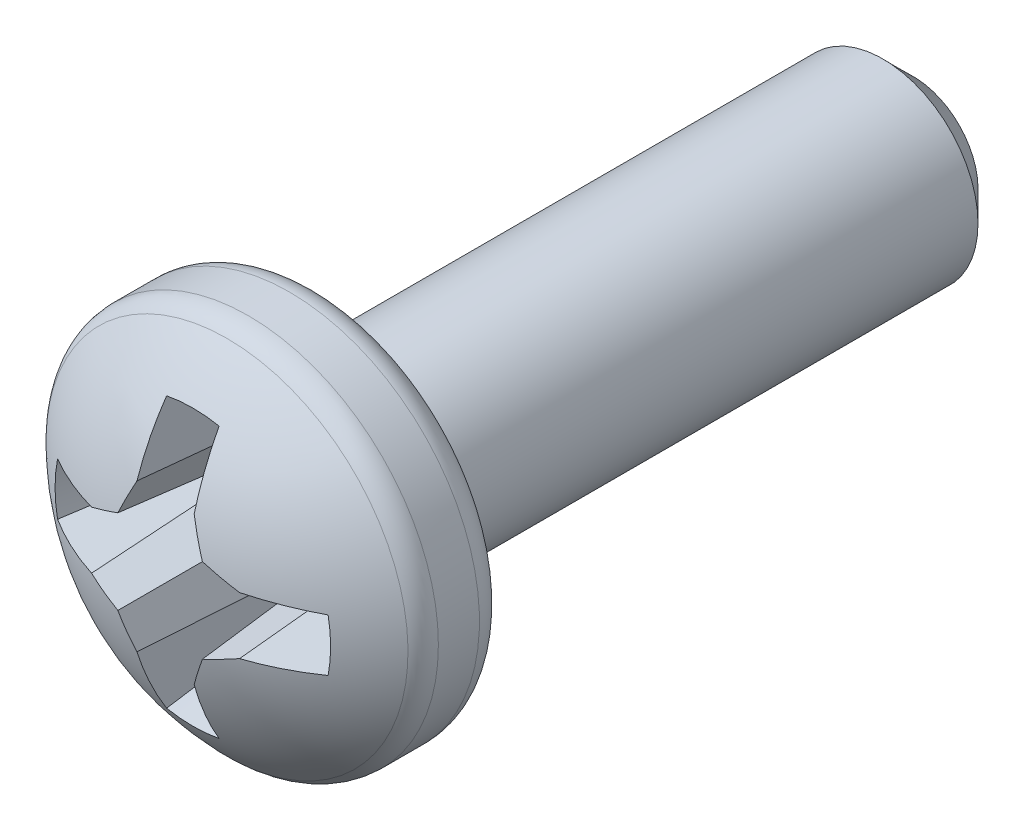
ISO-10303-21;
HEADER;
FILE_DESCRIPTION(('STEP AP214'),'2;1');
FILE_NAME('part.step','',(''),(''),'','','');
FILE_SCHEMA(('AUTOMOTIVE_DESIGN { 1 0 10303 214 1 1 1 1 }'));
ENDSEC;
DATA;
#1=APPLICATION_CONTEXT('core data for automotive mechanical design processes');
#2=APPLICATION_PROTOCOL_DEFINITION('international standard','automotive_design',2000,#1);
#3=PRODUCT_CONTEXT('',#1,'mechanical');
#4=PRODUCT('Part','Part','',(#3));
#5=PRODUCT_RELATED_PRODUCT_CATEGORY('part','',(#4));
#6=PRODUCT_DEFINITION_FORMATION('','',#4);
#7=PRODUCT_DEFINITION_CONTEXT('part definition',#1,'design');
#8=PRODUCT_DEFINITION('design','',#6,#7);
#9=PRODUCT_DEFINITION_SHAPE('','',#8);
#10=(LENGTH_UNIT() NAMED_UNIT(*) SI_UNIT(.MILLI.,.METRE.));
#11=(NAMED_UNIT(*) PLANE_ANGLE_UNIT() SI_UNIT($,.RADIAN.));
#12=(NAMED_UNIT(*) SI_UNIT($,.STERADIAN.) SOLID_ANGLE_UNIT());
#13=UNCERTAINTY_MEASURE_WITH_UNIT(LENGTH_MEASURE(1.E-05),#10,'distance_accuracy_value','');
#14=(GEOMETRIC_REPRESENTATION_CONTEXT(3) GLOBAL_UNCERTAINTY_ASSIGNED_CONTEXT((#13)) GLOBAL_UNIT_ASSIGNED_CONTEXT((#10,
#11,#12)) REPRESENTATION_CONTEXT('',''));
#15=CARTESIAN_POINT('',(0.,0.,0.));
#16=DIRECTION('',(0.,0.,1.));
#17=DIRECTION('',(1.,0.,0.));
#18=AXIS2_PLACEMENT_3D('',#15,#16,#17);
#19=CARTESIAN_POINT('',(0.124278325384204,0.791461441644268,0.413196607862429));
#20=DIRECTION('',(0.,0.,1.));
#21=DIRECTION('',(1.,0.,0.));
#22=AXIS2_PLACEMENT_3D('',#19,#20,#21);
#23=PLANE('',#22);
#24=DIRECTION('',(0.382683432365081,-0.92387953251129,0.));
#25=VECTOR('',#24,1.);
#26=CARTESIAN_POINT('',(0.137592212154071,0.796976234112247,0.413196607862429));
#27=LINE('',#26,#25);
#28=CARTESIAN_POINT('',(0.130021966738698,0.815252423264536,0.413196607862429));
#29=VERTEX_POINT('',#28);
#30=CARTESIAN_POINT('',(0.135307910320162,0.802491026580226,0.413196607862429));
#31=VERTEX_POINT('',#30);
#32=EDGE_CURVE('E292',#29,#31,#27,.T.);
#33=ORIENTED_EDGE('',*,*,#32,.F.);
#34=DIRECTION('',(0.,1.,0.));
#35=VECTOR('',#34,1.);
#36=CARTESIAN_POINT('',(0.130021966738698,0.791461441644268,0.413196607862429));
#37=LINE('',#36,#35);
#38=CARTESIAN_POINT('',(0.130021966738698,0.827667770286594,0.413196607862429));
#39=VERTEX_POINT('',#38);
#40=EDGE_CURVE('E168',#39,#29,#37,.F.);
#41=ORIENTED_EDGE('',*,*,#40,.F.);
#42=CARTESIAN_POINT('',(0.124278325384204,0.791461441644268,0.413196607862429));
#43=DIRECTION('',(0.,0.,1.));
#44=DIRECTION('',(1.,0.,0.));
#45=AXIS2_PLACEMENT_3D('',#42,#43,#44);
#46=CIRCLE('',#45,0.0366590732256715);
#47=CARTESIAN_POINT('',(0.118534684029712,0.827667770286594,0.413196607862429));
#48=VERTEX_POINT('',#47);
#49=EDGE_CURVE('E159',#39,#48,#46,.T.);
#50=ORIENTED_EDGE('',*,*,#49,.T.);
#51=DIRECTION('',(0.,1.,0.));
#52=VECTOR('',#51,1.);
#53=CARTESIAN_POINT('',(0.118534684029713,0.791461441644271,0.413196607862429));
#54=LINE('',#53,#52);
#55=CARTESIAN_POINT('',(0.118534684029712,0.815252423264539,0.413196607862429));
#56=VERTEX_POINT('',#55);
#57=EDGE_CURVE('E166',#56,#48,#54,.T.);
#58=ORIENTED_EDGE('',*,*,#57,.F.);
#59=DIRECTION('',(0.382683432365079,0.923879532511291,0.));
#60=VECTOR('',#59,1.);
#61=CARTESIAN_POINT('',(0.110964438614338,0.79697623411225,0.413196607862429));
#62=LINE('',#61,#60);
#63=CARTESIAN_POINT('',(0.113248740448248,0.802491026580229,0.413196607862429));
#64=VERTEX_POINT('',#63);
#65=EDGE_CURVE('E301',#64,#56,#62,.T.);
#66=ORIENTED_EDGE('',*,*,#65,.F.);
#67=DIRECTION('',(0.923879532511289,0.382683432365086,0.));
#68=VECTOR('',#67,1.);
#69=CARTESIAN_POINT('',(0.118763532916228,0.804775328414139,0.413196607862429));
#70=LINE('',#69,#68);
#71=CARTESIAN_POINT('',(0.100487343763938,0.797205082998765,0.413196607862429));
#72=VERTEX_POINT('',#71);
#73=EDGE_CURVE('E307',#72,#64,#70,.T.);
#74=ORIENTED_EDGE('',*,*,#73,.F.);
#75=DIRECTION('',(1.,0.,0.));
#76=VECTOR('',#75,1.);
#77=CARTESIAN_POINT('',(0.124278325384207,0.797205082998765,0.413196607862429));
#78=LINE('',#77,#76);
#79=CARTESIAN_POINT('',(0.0880719966765268,0.797205082997996,0.413196607853642));
#80=VERTEX_POINT('',#79);
#81=EDGE_CURVE('E313',#80,#72,#78,.T.);
#82=ORIENTED_EDGE('',*,*,#81,.F.);
#83=CARTESIAN_POINT('',(0.124278325384206,0.791461441644271,0.413196607862429));
#84=DIRECTION('',(0.,0.,1.));
#85=DIRECTION('',(1.,0.,0.));
#86=AXIS2_PLACEMENT_3D('',#83,#84,#85);
#87=CIRCLE('',#86,0.0366590732924525);
#88=CARTESIAN_POINT('',(0.0880719966742644,0.78571780028978,0.413196607862429));
#89=VERTEX_POINT('',#88);
#90=EDGE_CURVE('E410',#80,#89,#87,.T.);
#91=ORIENTED_EDGE('',*,*,#90,.T.);
#92=DIRECTION('',(1.,0.,0.));
#93=VECTOR('',#92,1.);
#94=CARTESIAN_POINT('',(0.124278325384204,0.78571780028978,0.413196607862429));
#95=LINE('',#94,#93);
#96=CARTESIAN_POINT('',(0.100487343763935,0.78571780028978,0.413196607862429));
#97=VERTEX_POINT('',#96);
#98=EDGE_CURVE('E247',#97,#89,#95,.F.);
#99=ORIENTED_EDGE('',*,*,#98,.F.);
#100=DIRECTION('',(-0.923879532511292,0.382683432365076,0.));
#101=VECTOR('',#100,1.);
#102=CARTESIAN_POINT('',(0.118763532916224,0.778147554874406,0.413196607862429));
#103=LINE('',#102,#101);
#104=CARTESIAN_POINT('',(0.113248740448245,0.780431856708316,0.413196607862429));
#105=VERTEX_POINT('',#104);
#106=EDGE_CURVE('E248',#105,#97,#103,.T.);
#107=ORIENTED_EDGE('',*,*,#106,.F.);
#108=DIRECTION('',(-0.38268343236509,0.923879532511287,0.));
#109=VECTOR('',#108,1.);
#110=CARTESIAN_POINT('',(0.110964438614335,0.785946649176296,0.413196607862429));
#111=LINE('',#110,#109);
#112=CARTESIAN_POINT('',(0.11853468402971,0.767670460024005,0.413196607862429));
#113=VERTEX_POINT('',#112);
#114=EDGE_CURVE('E254',#113,#105,#111,.T.);
#115=ORIENTED_EDGE('',*,*,#114,.F.);
#116=DIRECTION('',(0.,1.,0.));
#117=VECTOR('',#116,1.);
#118=CARTESIAN_POINT('',(0.118534684029709,0.791461441644275,0.413196607862429));
#119=LINE('',#118,#117);
#120=CARTESIAN_POINT('',(0.11853468402971,0.755255112971106,0.413196607862429));
#121=VERTEX_POINT('',#120);
#122=EDGE_CURVE('E260',#121,#113,#119,.T.);
#123=ORIENTED_EDGE('',*,*,#122,.F.);
#124=CARTESIAN_POINT('',(0.124278325384204,0.791461441644275,0.413196607862429));
#125=DIRECTION('',(0.,0.,1.));
#126=DIRECTION('',(1.,0.,0.));
#127=AXIS2_PLACEMENT_3D('',#124,#125,#126);
#128=CIRCLE('',#127,0.0366590732561332);
#129=CARTESIAN_POINT('',(0.130021966738695,0.755255112971106,0.413196607862429));
#130=VERTEX_POINT('',#129);
#131=EDGE_CURVE('E336',#121,#130,#128,.T.);
#132=ORIENTED_EDGE('',*,*,#131,.T.);
#133=DIRECTION('',(0.,1.,0.));
#134=VECTOR('',#133,1.);
#135=CARTESIAN_POINT('',(0.130021966738694,0.791461441644272,0.413196607862429));
#136=LINE('',#135,#134);
#137=CARTESIAN_POINT('',(0.130021966738695,0.767670460024002,0.413196607862429));
#138=VERTEX_POINT('',#137);
#139=EDGE_CURVE('E266',#138,#130,#136,.F.);
#140=ORIENTED_EDGE('',*,*,#139,.F.);
#141=DIRECTION('',(-0.382683432365075,-0.923879532511293,0.));
#142=VECTOR('',#141,1.);
#143=CARTESIAN_POINT('',(0.137592212154069,0.785946649176293,0.413196607862429));
#144=LINE('',#143,#142);
#145=CARTESIAN_POINT('',(0.135307910320159,0.780431856708313,0.413196607862429));
#146=VERTEX_POINT('',#145);
#147=EDGE_CURVE('E267',#146,#138,#144,.T.);
#148=ORIENTED_EDGE('',*,*,#147,.F.);
#149=DIRECTION('',(-0.923879532511286,-0.382683432365092,0.));
#150=VECTOR('',#149,1.);
#151=CARTESIAN_POINT('',(0.129793117852179,0.778147554874402,0.413196607862429));
#152=LINE('',#151,#150);
#153=CARTESIAN_POINT('',(0.148069307004469,0.785717800289777,0.413196607862429));
#154=VERTEX_POINT('',#153);
#155=EDGE_CURVE('E273',#154,#146,#152,.T.);
#156=ORIENTED_EDGE('',*,*,#155,.F.);
#157=DIRECTION('',(1.,0.,0.));
#158=VECTOR('',#157,1.);
#159=CARTESIAN_POINT('',(0.1242783253842,0.785717800289777,0.413196607862429));
#160=LINE('',#159,#158);
#161=CARTESIAN_POINT('',(0.16048465402653,0.785717800289777,0.413196607862429));
#162=VERTEX_POINT('',#161);
#163=EDGE_CURVE('E279',#162,#154,#160,.F.);
#164=ORIENTED_EDGE('',*,*,#163,.F.);
#165=CARTESIAN_POINT('',(0.124278325384204,0.791461441644268,0.413196607862429));
#166=DIRECTION('',(0.,0.,1.));
#167=DIRECTION('',(1.,0.,0.));
#168=AXIS2_PLACEMENT_3D('',#165,#166,#167);
#169=CIRCLE('',#168,0.0366590732256715);
#170=CARTESIAN_POINT('',(0.16048465402653,0.797205082998762,0.413196607862429));
#171=VERTEX_POINT('',#170);
#172=EDGE_CURVE('E492',#162,#171,#169,.T.);
#173=ORIENTED_EDGE('',*,*,#172,.T.);
#174=DIRECTION('',(1.,0.,0.));
#175=VECTOR('',#174,1.);
#176=CARTESIAN_POINT('',(0.124278325384204,0.797205082998762,0.413196607862429));
#177=LINE('',#176,#175);
#178=CARTESIAN_POINT('',(0.148069307004472,0.797205082998762,0.413196607862429));
#179=VERTEX_POINT('',#178);
#180=EDGE_CURVE('E285',#179,#171,#177,.T.);
#181=ORIENTED_EDGE('',*,*,#180,.F.);
#182=DIRECTION('',(0.92387953251129,-0.382683432365083,0.));
#183=VECTOR('',#182,1.);
#184=CARTESIAN_POINT('',(0.129793117852183,0.804775328414136,0.413196607862429));
#185=LINE('',#184,#183);
#186=EDGE_CURVE('E286',#31,#179,#185,.T.);
#187=ORIENTED_EDGE('',*,*,#186,.F.);
#188=EDGE_LOOP('',(#33,#41,#50,#58,#66,#74,#82,#91,#99,#107,#115,#123,#132,#140,#148,#156,#164,
#173,#181,#187));
#189=FACE_BOUND('',#188,.T.);
#190=ADVANCED_FACE('F17',(#189),#23,.T.);
#191=CARTESIAN_POINT('',(0.124278325384207,0.801303961329311,0.460047001563216));
#192=DIRECTION('',(0.,-0.996194698091744,0.0871557427476727));
#193=DIRECTION('',(0.,-0.0871557427476727,-0.996194698091744));
#194=AXIS2_PLACEMENT_3D('',#191,#192,#193);
#195=PLANE('',#194);
#196=DIRECTION('',(0.0173337504938532,-0.0871426484044507,-0.996045029063885));
#197=VECTOR('',#196,1.);
#198=CARTESIAN_POINT('',(0.0997439432595786,0.8009424097128,0.455914447676356));
#199=LINE('',#198,#197);
#200=CARTESIAN_POINT('',(0.0997439432595786,0.8009424097128,0.455914447676356));
#201=VERTEX_POINT('',#200);
#202=EDGE_CURVE('E310',#201,#72,#199,.T.);
#203=ORIENTED_EDGE('',*,*,#202,.F.);
#204=CARTESIAN_POINT('',(0.0794306923124,0.80015108887588,0.446869609122097));
#205=CARTESIAN_POINT('',(0.0826190519955653,0.800321424804083,0.448816557690383));
#206=CARTESIAN_POINT('',(0.0859060027494076,0.800472536171256,0.450543768520712));
#207=CARTESIAN_POINT('',(0.0926770863984459,0.800736309783544,0.453558714705461));
#208=CARTESIAN_POINT('',(0.096161219293642,0.800848972028658,0.45484645005988));
#209=CARTESIAN_POINT('',(0.0997439432595149,0.800942409712743,0.455914447676343));
#210=B_SPLINE_CURVE_WITH_KNOTS('',3,(#204,#205,#206,#207,#208,#209),.UNSPECIFIED.,.F.,.F.,(4,2,
4),(0.,0.0111485978671282,0.0222971957342564),.UNSPECIFIED.);
#211=CARTESIAN_POINT('',(0.0794306923229776,0.800151088874493,0.446869609106244));
#212=VERTEX_POINT('',#211);
#213=EDGE_CURVE('E409',#212,#201,#210,.T.);
#214=ORIENTED_EDGE('',*,*,#213,.F.);
#215=CARTESIAN_POINT('',(0.0794306923335552,0.800151088873107,0.446869609090391));
#216=CARTESIAN_POINT('',(0.0808671601113171,0.79966000435443,0.441256487356838));
#217=CARTESIAN_POINT('',(0.0823055026868713,0.799168961608414,0.435643843086986));
#218=CARTESIAN_POINT('',(0.0851859374685245,0.798186959649785,0.424419509338453));
#219=CARTESIAN_POINT('',(0.0866280296747145,0.797696000437175,0.418807819859794));
#220=CARTESIAN_POINT('',(0.0880719966787879,0.797205082997228,0.413196607844861));
#221=B_SPLINE_CURVE_WITH_KNOTS('',3,(#215,#216,#217,#218,#219,#220),.UNSPECIFIED.,.F.,.F.,(4,2,
4),(0.,0.0174443558891327,0.0348887122017158),.UNSPECIFIED.);
#222=EDGE_CURVE('E318',#212,#80,#221,.T.);
#223=ORIENTED_EDGE('',*,*,#222,.T.);
#224=ORIENTED_EDGE('',*,*,#81,.T.);
#225=EDGE_LOOP('',(#203,#214,#223,#224));
#226=FACE_BOUND('',#225,.T.);
#227=ADVANCED_FACE('F427',(#226),#195,.T.);
#228=CARTESIAN_POINT('',(0.117194960087848,0.808562198209984,0.460047001563216));
#229=DIRECTION('',(0.381227206369649,-0.920363891963225,0.0871557427476661));
#230=DIRECTION('',(0.923879532511289,0.382683432365086,0.));
#231=AXIS2_PLACEMENT_3D('',#228,#229,#230);
#232=PLANE('',#231);
#233=DIRECTION('',(0.0666626913468204,-0.0666626913468417,-0.995546167269401));
#234=VECTOR('',#233,1.);
#235=CARTESIAN_POINT('',(0.110266961696687,0.805472805331791,0.457726739301586));
#236=LINE('',#235,#234);
#237=CARTESIAN_POINT('',(0.110266961696687,0.805472805331791,0.457726739301586));
#238=VERTEX_POINT('',#237);
#239=EDGE_CURVE('E304',#238,#64,#236,.T.);
#240=ORIENTED_EDGE('',*,*,#239,.F.);
#241=CARTESIAN_POINT('',(0.0997439432595787,0.8009424097128,0.455914447676356));
#242=CARTESIAN_POINT('',(0.101474312814514,0.801700049456703,0.456346321822599));
#243=CARTESIAN_POINT('',(0.103216415795073,0.802456402296903,0.456713283197823));
#244=CARTESIAN_POINT('',(0.106724088607443,0.8039665341699,0.457317380406233));
#245=CARTESIAN_POINT('',(0.108489658439252,0.804720313202697,0.457554516239419));
#246=CARTESIAN_POINT('',(0.110266961696687,0.805472805331791,0.457726739301586));
#247=B_SPLINE_CURVE_WITH_KNOTS('',3,(#241,#242,#243,#244,#245,#246),.UNSPECIFIED.,.F.,.F.,(4,2,
4),(0.,0.00580300590917745,0.0116060118183549),.UNSPECIFIED.);
#248=EDGE_CURVE('E439',#201,#238,#247,.T.);
#249=ORIENTED_EDGE('',*,*,#248,.F.);
#250=ORIENTED_EDGE('',*,*,#202,.T.);
#251=ORIENTED_EDGE('',*,*,#73,.T.);
#252=EDGE_LOOP('',(#240,#249,#250,#251));
#253=FACE_BOUND('',#252,.T.);
#254=ADVANCED_FACE('F431',(#253),#232,.T.);
#255=CARTESIAN_POINT('',(0.107177568818494,0.79854480694063,0.460047001563216));
#256=DIRECTION('',(0.920363891963229,-0.381227206369643,0.0871557427476506));
#257=DIRECTION('',(0.382683432365079,0.923879532511291,0.));
#258=AXIS2_PLACEMENT_3D('',#255,#256,#257);
#259=PLANE('',#258);
#260=DIRECTION('',(0.0871426484044251,-0.0173337504938855,-0.996045029063886));
#261=VECTOR('',#260,1.);
#262=CARTESIAN_POINT('',(0.114797357315678,0.8159958237689,0.455914447676355));
#263=LINE('',#262,#261);
#264=CARTESIAN_POINT('',(0.114797357315678,0.8159958237689,0.455914447676355));
#265=VERTEX_POINT('',#264);
#266=EDGE_CURVE('E176',#265,#56,#263,.T.);
#267=ORIENTED_EDGE('',*,*,#266,.F.);
#268=CARTESIAN_POINT('',(0.110266961696687,0.805472805331791,0.457726739301586));
#269=CARTESIAN_POINT('',(0.111019453825782,0.807250108589226,0.457554516239419));
#270=CARTESIAN_POINT('',(0.111773232858578,0.809015678421036,0.457317380406232));
#271=CARTESIAN_POINT('',(0.113283364731575,0.812523351233405,0.456713283197822));
#272=CARTESIAN_POINT('',(0.114039717571776,0.814265454213965,0.456346321822598));
#273=CARTESIAN_POINT('',(0.114797357315678,0.8159958237689,0.455914447676355));
#274=B_SPLINE_CURVE_WITH_KNOTS('',3,(#268,#269,#270,#271,#272,#273),.UNSPECIFIED.,.F.,.F.,(4,2,
4),(0.,0.00580300590917783,0.0116060118183556),.UNSPECIFIED.);
#275=EDGE_CURVE('E445',#238,#265,#274,.T.);
#276=ORIENTED_EDGE('',*,*,#275,.F.);
#277=ORIENTED_EDGE('',*,*,#239,.T.);
#278=ORIENTED_EDGE('',*,*,#65,.T.);
#279=EDGE_LOOP('',(#267,#276,#277,#278));
#280=FACE_BOUND('',#279,.T.);
#281=ADVANCED_FACE('F436',(#280),#259,.T.);
#282=CARTESIAN_POINT('',(0.114435805699168,0.791461441644271,0.460047001563216));
#283=DIRECTION('',(0.996194698091747,0.,0.0871557427476441));
#284=DIRECTION('',(0.0871557427476441,0.,-0.996194698091747));
#285=AXIS2_PLACEMENT_3D('',#282,#283,#284);
#286=PLANE('',#285);
#287=CARTESIAN_POINT('',(0.118534684022761,0.827667770296489,0.413196607883206));
#288=CARTESIAN_POINT('',(0.118043766585455,0.829111737305351,0.418807819897292));
#289=CARTESIAN_POINT('',(0.117552807374652,0.830553829517049,0.424419509374847));
#290=CARTESIAN_POINT('',(0.116570805417973,0.833434264311158,0.435643843120664));
#291=CARTESIAN_POINT('',(0.116079762672099,0.834872606893661,0.441256487388902));
#292=CARTESIAN_POINT('',(0.11558867815273,0.836309074679091,0.446869609120586));
#293=B_SPLINE_CURVE_WITH_KNOTS('',3,(#287,#288,#289,#290,#291,#292),.UNSPECIFIED.,.F.,.F.,(4,2,
4),(0.,0.0174443563130294,0.0348887122026101),.UNSPECIFIED.);
#294=CARTESIAN_POINT('',(0.115588678153339,0.836309074677309,0.446869609113626));
#295=VERTEX_POINT('',#294);
#296=EDGE_CURVE('E170',#48,#295,#293,.T.);
#297=ORIENTED_EDGE('',*,*,#296,.T.);
#298=CARTESIAN_POINT('',(0.114797357315678,0.8159958237689,0.455914447676355));
#299=CARTESIAN_POINT('',(0.114890794999709,0.81957854773162,0.454846450060843));
#300=CARTESIAN_POINT('',(0.115003457244727,0.82306268062386,0.453558714707745));
#301=CARTESIAN_POINT('',(0.115267230856735,0.829833764267379,0.450543768526379));
#302=CARTESIAN_POINT('',(0.115418342223726,0.833120715018658,0.44881655769811));
#303=CARTESIAN_POINT('',(0.115588678151704,0.836309074699457,0.446869609132256));
#304=B_SPLINE_CURVE_WITH_KNOTS('',3,(#298,#299,#300,#301,#302,#303),.UNSPECIFIED.,.F.,.F.,(4,2,
4),(0.,0.0111485978574312,0.0222971957148624),.UNSPECIFIED.);
#305=EDGE_CURVE('E450',#265,#295,#304,.T.);
#306=ORIENTED_EDGE('',*,*,#305,.F.);
#307=ORIENTED_EDGE('',*,*,#266,.T.);
#308=ORIENTED_EDGE('',*,*,#57,.T.);
#309=EDGE_LOOP('',(#297,#306,#307,#308));
#310=FACE_BOUND('',#309,.T.);
#311=ADVANCED_FACE('F173',(#310),#286,.T.);
#312=CARTESIAN_POINT('',(0.124278325384204,0.791461441644268,0.44686960910667));
#313=DIRECTION('',(0.,0.,1.));
#314=DIRECTION('',(0.,-1.,0.));
#315=AXIS2_PLACEMENT_3D('',#312,#313,#314);
#316=CONICAL_SURFACE('',#315,0.0456817267350184,0.261799388331704);
#317=ORIENTED_EDGE('',*,*,#296,.F.);
#318=ORIENTED_EDGE('',*,*,#49,.F.);
#319=CARTESIAN_POINT('',(0.132967972623113,0.836309074686799,0.446869609128));
#320=CARTESIAN_POINT('',(0.132476888101021,0.834872606898678,0.441256487394183));
#321=CARTESIAN_POINT('',(0.131985845352692,0.833434264313674,0.43564384312374));
#322=CARTESIAN_POINT('',(0.131003843391642,0.830553829514943,0.42441950937337));
#323=CARTESIAN_POINT('',(0.130512884178923,0.829111737301125,0.418807819893466));
#324=CARTESIAN_POINT('',(0.130021966739969,0.827667770290334,0.413196607876959));
#325=B_SPLINE_CURVE_WITH_KNOTS('',3,(#319,#320,#321,#322,#323,#324),.UNSPECIFIED.,.F.,.F.,(4,2,
4),(0.,0.0174443558984414,0.0348887122203348),.UNSPECIFIED.);
#326=CARTESIAN_POINT('',(0.132967972616585,0.836309074690764,0.446869609130918));
#327=VERTEX_POINT('',#326);
#328=EDGE_CURVE('E182',#327,#39,#325,.T.);
#329=ORIENTED_EDGE('',*,*,#328,.F.);
#330=CARTESIAN_POINT('',(0.124278325384204,0.791461441644268,0.44686960910667));
#331=DIRECTION('',(0.,0.,1.));
#332=DIRECTION('',(0.,-1.,0.));
#333=AXIS2_PLACEMENT_3D('',#330,#331,#332);
#334=CIRCLE('',#333,0.0456817267350184);
#335=EDGE_CURVE('E180',#295,#327,#334,.F.);
#336=ORIENTED_EDGE('',*,*,#335,.F.);
#337=EDGE_LOOP('',(#317,#318,#329,#336));
#338=FACE_BOUND('',#337,.T.);
#339=ADVANCED_FACE('F178',(#338),#316,.F.);
#340=CARTESIAN_POINT('',(0.134120845069243,0.791461441644268,0.460047001563216));
#341=DIRECTION('',(-0.996194698091746,0.,0.0871557427476584));
#342=DIRECTION('',(0.0871557427476584,0.,0.996194698091746));
#343=AXIS2_PLACEMENT_3D('',#340,#341,#342);
#344=PLANE('',#343);
#345=DIRECTION('',(-0.0871426484044387,-0.0173337504938649,-0.996045029063886));
#346=VECTOR('',#345,1.);
#347=CARTESIAN_POINT('',(0.133759293452732,0.815995823768896,0.455914447676356));
#348=LINE('',#347,#346);
#349=CARTESIAN_POINT('',(0.133759293452732,0.815995823768896,0.455914447676356));
#350=VERTEX_POINT('',#349);
#351=EDGE_CURVE('E295',#350,#29,#348,.T.);
#352=ORIENTED_EDGE('',*,*,#351,.F.);
#353=CARTESIAN_POINT('',(0.13296797261667,0.836309074700043,0.446869609131898));
#354=CARTESIAN_POINT('',(0.133138308544657,0.833120715019162,0.448816557697837));
#355=CARTESIAN_POINT('',(0.133289419911656,0.829833764267794,0.450543768526177));
#356=CARTESIAN_POINT('',(0.133553193523679,0.823062680624083,0.453558714707662));
#357=CARTESIAN_POINT('',(0.133665855768702,0.81957854773174,0.454846450060805));
#358=CARTESIAN_POINT('',(0.133759293452738,0.81599582376891,0.455914447676351));
#359=B_SPLINE_CURVE_WITH_KNOTS('',3,(#353,#354,#355,#356,#357,#358),.UNSPECIFIED.,.F.,.F.,(4,2,
4),(0.,0.0111485978577688,0.0222971957155376),.UNSPECIFIED.);
#360=EDGE_CURVE('E210',#327,#350,#359,.T.);
#361=ORIENTED_EDGE('',*,*,#360,.F.);
#362=ORIENTED_EDGE('',*,*,#328,.T.);
#363=ORIENTED_EDGE('',*,*,#40,.T.);
#364=EDGE_LOOP('',(#352,#361,#362,#363));
#365=FACE_BOUND('',#364,.T.);
#366=ADVANCED_FACE('F199',(#365),#344,.T.);
#367=CARTESIAN_POINT('',(0.141379081949916,0.798544806940627,0.460047001563216));
#368=DIRECTION('',(-0.920363891963228,-0.381227206369645,0.0871557427476584));
#369=DIRECTION('',(0.382683432365081,-0.92387953251129,0.));
#370=AXIS2_PLACEMENT_3D('',#367,#368,#369);
#371=PLANE('',#370);
#372=DIRECTION('',(-0.0666626913468384,-0.0666626913468294,-0.995546167269401));
#373=VECTOR('',#372,1.);
#374=CARTESIAN_POINT('',(0.138289689071724,0.805472805331788,0.457726739301586));
#375=LINE('',#374,#373);
#376=CARTESIAN_POINT('',(0.138289689071724,0.805472805331788,0.457726739301586));
#377=VERTEX_POINT('',#376);
#378=EDGE_CURVE('E289',#377,#31,#375,.T.);
#379=ORIENTED_EDGE('',*,*,#378,.F.);
#380=CARTESIAN_POINT('',(0.133759293452732,0.815995823768896,0.455914447676356));
#381=CARTESIAN_POINT('',(0.134516933196635,0.814265454213961,0.456346321822599));
#382=CARTESIAN_POINT('',(0.135273286036835,0.812523351233401,0.456713283197823));
#383=CARTESIAN_POINT('',(0.136783417909832,0.809015678421032,0.457317380406233));
#384=CARTESIAN_POINT('',(0.137537196942629,0.807250108589222,0.457554516239419));
#385=CARTESIAN_POINT('',(0.138289689071723,0.805472805331788,0.457726739301586));
#386=B_SPLINE_CURVE_WITH_KNOTS('',3,(#380,#381,#382,#383,#384,#385),.UNSPECIFIED.,.F.,.F.,(4,2,
4),(0.,0.00580300590917733,0.0116060118183546),.UNSPECIFIED.);
#387=EDGE_CURVE('E218',#350,#377,#386,.T.);
#388=ORIENTED_EDGE('',*,*,#387,.F.);
#389=ORIENTED_EDGE('',*,*,#351,.T.);
#390=ORIENTED_EDGE('',*,*,#32,.T.);
#391=EDGE_LOOP('',(#379,#388,#389,#390));
#392=FACE_BOUND('',#391,.T.);
#393=ADVANCED_FACE('F204',(#392),#371,.T.);
#394=CARTESIAN_POINT('',(0.131361690680563,0.808562198209981,0.460047001563216));
#395=DIRECTION('',(-0.381227206369647,-0.920363891963227,0.0871557427476583));
#396=DIRECTION('',(0.92387953251129,-0.382683432365083,0.));
#397=AXIS2_PLACEMENT_3D('',#394,#395,#396);
#398=PLANE('',#397);
#399=DIRECTION('',(-0.0173337504938617,-0.0871426484044405,-0.996045029063885));
#400=VECTOR('',#399,1.);
#401=CARTESIAN_POINT('',(0.148812707508832,0.800942409712797,0.455914447676356));
#402=LINE('',#401,#400);
#403=CARTESIAN_POINT('',(0.148812707508832,0.800942409712797,0.455914447676356));
#404=VERTEX_POINT('',#403);
#405=EDGE_CURVE('E282',#404,#179,#402,.T.);
#406=ORIENTED_EDGE('',*,*,#405,.F.);
#407=CARTESIAN_POINT('',(0.138289689071724,0.805472805331788,0.457726739301586));
#408=CARTESIAN_POINT('',(0.140066992329158,0.804720313202693,0.457554516239419));
#409=CARTESIAN_POINT('',(0.141832562160968,0.803966534169897,0.457317380406233));
#410=CARTESIAN_POINT('',(0.145340234973338,0.8024564022969,0.456713283197823));
#411=CARTESIAN_POINT('',(0.147082337953897,0.8017000494567,0.456346321822598));
#412=CARTESIAN_POINT('',(0.148812707508832,0.800942409712797,0.455914447676355));
#413=B_SPLINE_CURVE_WITH_KNOTS('',3,(#407,#408,#409,#410,#411,#412),.UNSPECIFIED.,.F.,.F.,(4,2,
4),(0.,0.00580300590917736,0.0116060118183548),.UNSPECIFIED.);
#414=EDGE_CURVE('E462',#377,#404,#413,.T.);
#415=ORIENTED_EDGE('',*,*,#414,.F.);
#416=ORIENTED_EDGE('',*,*,#378,.T.);
#417=ORIENTED_EDGE('',*,*,#186,.T.);
#418=EDGE_LOOP('',(#406,#415,#416,#417));
#419=FACE_BOUND('',#418,.T.);
#420=ADVANCED_FACE('F474',(#419),#398,.T.);
#421=CARTESIAN_POINT('',(0.124278325384204,0.801303961329307,0.460047001563216));
#422=DIRECTION('',(0.,-0.996194698091746,0.0871557427476584));
#423=DIRECTION('',(0.,-0.0871557427476584,-0.996194698091746));
#424=AXIS2_PLACEMENT_3D('',#421,#422,#423);
#425=PLANE('',#424);
#426=CARTESIAN_POINT('',(0.160484654031833,0.797205083000564,0.41319660788303));
#427=CARTESIAN_POINT('',(0.161928621042846,0.797696000440396,0.418807819896643));
#428=CARTESIAN_POINT('',(0.163370713256003,0.79818695965289,0.424419509373977));
#429=CARTESIAN_POINT('',(0.166251148051643,0.799168961611286,0.435643843119852));
#430=CARTESIAN_POINT('',(0.167689490634218,0.799660004357185,0.441256487388371));
#431=CARTESIAN_POINT('',(0.169125958419026,0.800151088875745,0.446869609120586));
#432=B_SPLINE_CURVE_WITH_KNOTS('',3,(#426,#427,#428,#429,#430,#431),.UNSPECIFIED.,.F.,.F.,(4,2,
4),(0.,0.017444356313902,0.0348887122043537),.UNSPECIFIED.);
#433=CARTESIAN_POINT('',(0.169125958417244,0.800151088875136,0.446869609113626));
#434=VERTEX_POINT('',#433);
#435=EDGE_CURVE('E351',#171,#434,#432,.T.);
#436=ORIENTED_EDGE('',*,*,#435,.T.);
#437=CARTESIAN_POINT('',(0.148812707508832,0.800942409712797,0.455914447676355));
#438=CARTESIAN_POINT('',(0.152395431471565,0.800848972028785,0.454846450060838));
#439=CARTESIAN_POINT('',(0.155879564363817,0.800736309783767,0.453558714707735));
#440=CARTESIAN_POINT('',(0.162650648007359,0.800472536171718,0.450543768526359));
#441=CARTESIAN_POINT('',(0.16593759875865,0.800321424804688,0.448816557698086));
#442=CARTESIAN_POINT('',(0.169125958439459,0.800151088876652,0.446869609132229));
#443=B_SPLINE_CURVE_WITH_KNOTS('',3,(#437,#438,#439,#440,#441,#442),.UNSPECIFIED.,.F.,.F.,(4,2,
4),(0.,0.0111485978574711,0.0222971957149421),.UNSPECIFIED.);
#444=EDGE_CURVE('E463',#404,#434,#443,.T.);
#445=ORIENTED_EDGE('',*,*,#444,.F.);
#446=ORIENTED_EDGE('',*,*,#405,.T.);
#447=ORIENTED_EDGE('',*,*,#180,.T.);
#448=EDGE_LOOP('',(#436,#445,#446,#447));
#449=FACE_BOUND('',#448,.T.);
#450=ADVANCED_FACE('F477',(#449),#425,.T.);
#451=CARTESIAN_POINT('',(0.124278325384204,0.791461441644268,0.44686960910667));
#452=DIRECTION('',(0.,0.,1.));
#453=DIRECTION('',(0.,-1.,0.));
#454=AXIS2_PLACEMENT_3D('',#451,#452,#453);
#455=CONICAL_SURFACE('',#454,0.0456817267350184,0.261799388331704);
#456=ORIENTED_EDGE('',*,*,#172,.F.);
#457=CARTESIAN_POINT('',(0.169125958426736,0.782771794405362,0.446869609128));
#458=CARTESIAN_POINT('',(0.167689490638542,0.783262878927479,0.441256487393903));
#459=CARTESIAN_POINT('',(0.166251148053467,0.783753921675832,0.43564384312318));
#460=CARTESIAN_POINT('',(0.163370713254592,0.78473592363693,0.42441950937225));
#461=CARTESIAN_POINT('',(0.161928621040701,0.785226882849674,0.418807819892066));
#462=CARTESIAN_POINT('',(0.160484654029838,0.785717800288653,0.413196607875279));
#463=B_SPLINE_CURVE_WITH_KNOTS('',3,(#457,#458,#459,#460,#461,#462),.UNSPECIFIED.,.F.,.F.,(4,2,
4),(0.,0.017444355899312,0.034888712222076),.UNSPECIFIED.);
#464=CARTESIAN_POINT('',(0.1691259584307,0.782771794411891,0.446869609130918));
#465=VERTEX_POINT('',#464);
#466=EDGE_CURVE('E346',#465,#162,#463,.T.);
#467=ORIENTED_EDGE('',*,*,#466,.F.);
#468=CARTESIAN_POINT('',(0.124278325384204,0.791461441644268,0.44686960910667));
#469=DIRECTION('',(0.,0.,1.));
#470=DIRECTION('',(0.,-1.,0.));
#471=AXIS2_PLACEMENT_3D('',#468,#469,#470);
#472=CIRCLE('',#471,0.0456817267350184);
#473=EDGE_CURVE('E464',#434,#465,#472,.F.);
#474=ORIENTED_EDGE('',*,*,#473,.F.);
#475=ORIENTED_EDGE('',*,*,#435,.F.);
#476=EDGE_LOOP('',(#456,#467,#474,#475));
#477=FACE_BOUND('',#476,.T.);
#478=ADVANCED_FACE('F482',(#477),#455,.F.);
#479=CARTESIAN_POINT('',(0.1242783253842,0.781618921959232,0.460047001563216));
#480=DIRECTION('',(0.,0.996194698091747,0.0871557427476441));
#481=DIRECTION('',(0.,-0.0871557427476441,0.996194698091747));
#482=AXIS2_PLACEMENT_3D('',#479,#480,#481);
#483=PLANE('',#482);
#484=DIRECTION('',(-0.017333750493843,0.0871426484044235,-0.996045029063887));
#485=VECTOR('',#484,1.);
#486=CARTESIAN_POINT('',(0.148812707508828,0.781980473575742,0.455914447676357));
#487=LINE('',#486,#485);
#488=CARTESIAN_POINT('',(0.148812707508828,0.781980473575742,0.455914447676357));
#489=VERTEX_POINT('',#488);
#490=EDGE_CURVE('E276',#489,#154,#487,.T.);
#491=ORIENTED_EDGE('',*,*,#490,.F.);
#492=CARTESIAN_POINT('',(0.16912595843998,0.782771794411805,0.446869609131898));
#493=CARTESIAN_POINT('',(0.165937598759105,0.782601458483808,0.448816557697832));
#494=CARTESIAN_POINT('',(0.162650648007744,0.782450347116809,0.450543768526169));
#495=CARTESIAN_POINT('',(0.155879564364048,0.782186573504808,0.453558714707651));
#496=CARTESIAN_POINT('',(0.152395431471713,0.782073911259805,0.454846450060796));
#497=CARTESIAN_POINT('',(0.148812707508892,0.7819804735758,0.455914447676345));
#498=B_SPLINE_CURVE_WITH_KNOTS('',3,(#492,#493,#494,#495,#496,#497),.UNSPECIFIED.,.F.,.F.,(4,2,
4),(0.,0.0111485978577458,0.0222971957154915),.UNSPECIFIED.);
#499=EDGE_CURVE('E509',#465,#489,#498,.T.);
#500=ORIENTED_EDGE('',*,*,#499,.F.);
#501=ORIENTED_EDGE('',*,*,#466,.T.);
#502=ORIENTED_EDGE('',*,*,#163,.T.);
#503=EDGE_LOOP('',(#491,#500,#501,#502));
#504=FACE_BOUND('',#503,.T.);
#505=ADVANCED_FACE('F499',(#504),#483,.T.);
#506=CARTESIAN_POINT('',(0.131361690680559,0.774360685078558,0.460047001563216));
#507=DIRECTION('',(-0.381227206369656,0.920363891963225,0.0871557427476397));
#508=DIRECTION('',(-0.923879532511286,-0.382683432365092,0.));
#509=AXIS2_PLACEMENT_3D('',#506,#507,#508);
#510=PLANE('',#509);
#511=DIRECTION('',(-0.0666626913468176,0.0666626913468194,-0.995546167269403));
#512=VECTOR('',#511,1.);
#513=CARTESIAN_POINT('',(0.13828968907172,0.777450077956752,0.457726739301588));
#514=LINE('',#513,#512);
#515=CARTESIAN_POINT('',(0.13828968907172,0.777450077956752,0.457726739301588));
#516=VERTEX_POINT('',#515);
#517=EDGE_CURVE('E270',#516,#146,#514,.T.);
#518=ORIENTED_EDGE('',*,*,#517,.F.);
#519=CARTESIAN_POINT('',(0.148812707508828,0.781980473575742,0.455914447676357));
#520=CARTESIAN_POINT('',(0.147082337953894,0.781222833831839,0.4563463218226));
#521=CARTESIAN_POINT('',(0.145340234973334,0.780466480991639,0.456713283197824));
#522=CARTESIAN_POINT('',(0.141832562160964,0.778956349118642,0.457317380406234));
#523=CARTESIAN_POINT('',(0.140066992329155,0.778202570085846,0.45755451623942));
#524=CARTESIAN_POINT('',(0.13828968907172,0.777450077956751,0.457726739301587));
#525=B_SPLINE_CURVE_WITH_KNOTS('',3,(#519,#520,#521,#522,#523,#524),.UNSPECIFIED.,.F.,.F.,(4,2,
4),(0.,0.00580300590917726,0.0116060118183545),.UNSPECIFIED.);
#526=EDGE_CURVE('E515',#489,#516,#525,.T.);
#527=ORIENTED_EDGE('',*,*,#526,.F.);
#528=ORIENTED_EDGE('',*,*,#490,.T.);
#529=ORIENTED_EDGE('',*,*,#155,.T.);
#530=EDGE_LOOP('',(#518,#527,#528,#529));
#531=FACE_BOUND('',#530,.T.);
#532=ADVANCED_FACE('F503',(#531),#510,.T.);
#533=CARTESIAN_POINT('',(0.141379081949913,0.784378076347913,0.460047001563216));
#534=DIRECTION('',(-0.920363891963232,0.381227206369639,0.0871557427476397));
#535=DIRECTION('',(-0.382683432365075,-0.923879532511293,0.));
#536=AXIS2_PLACEMENT_3D('',#533,#534,#535);
#537=PLANE('',#536);
#538=DIRECTION('',(-0.0871426484044254,0.0173337504938367,-0.996045029063887));
#539=VECTOR('',#538,1.);
#540=CARTESIAN_POINT('',(0.133759293452729,0.766927059519643,0.455914447676357));
#541=LINE('',#540,#539);
#542=CARTESIAN_POINT('',(0.133759293452729,0.766927059519643,0.455914447676357));
#543=VERTEX_POINT('',#542);
#544=EDGE_CURVE('E263',#543,#138,#541,.T.);
#545=ORIENTED_EDGE('',*,*,#544,.F.);
#546=CARTESIAN_POINT('',(0.13828968907172,0.777450077956752,0.457726739301587));
#547=CARTESIAN_POINT('',(0.137537196942626,0.775672774699317,0.45755451623942));
#548=CARTESIAN_POINT('',(0.136783417909829,0.773907204867507,0.457317380406234));
#549=CARTESIAN_POINT('',(0.135273286036832,0.770399532055138,0.456713283197824));
#550=CARTESIAN_POINT('',(0.134516933196632,0.768657429074578,0.4563463218226));
#551=CARTESIAN_POINT('',(0.133759293452729,0.766927059519643,0.455914447676357));
#552=B_SPLINE_CURVE_WITH_KNOTS('',3,(#546,#547,#548,#549,#550,#551),.UNSPECIFIED.,.F.,.F.,(4,2,
4),(0.,0.00580300590917772,0.0116060118183554),.UNSPECIFIED.);
#553=EDGE_CURVE('E535',#516,#543,#552,.T.);
#554=ORIENTED_EDGE('',*,*,#553,.F.);
#555=ORIENTED_EDGE('',*,*,#517,.T.);
#556=ORIENTED_EDGE('',*,*,#147,.T.);
#557=EDGE_LOOP('',(#545,#554,#555,#556));
#558=FACE_BOUND('',#557,.T.);
#559=ADVANCED_FACE('F548',(#558),#537,.T.);
#560=CARTESIAN_POINT('',(0.134120845069239,0.791461441644272,0.460047001563216));
#561=DIRECTION('',(-0.996194698091747,0.,0.0871557427476441));
#562=DIRECTION('',(0.0871557427476441,0.,0.996194698091747));
#563=AXIS2_PLACEMENT_3D('',#560,#561,#562);
#564=PLANE('',#563);
#565=CARTESIAN_POINT('',(0.130021966740438,0.755255112965977,0.41319660788235));
#566=CARTESIAN_POINT('',(0.130512884180224,0.753811145955062,0.418807819895447));
#567=CARTESIAN_POINT('',(0.131003843392673,0.752369053742004,0.424419509372265));
#568=CARTESIAN_POINT('',(0.131985845350979,0.749488618946566,0.43564384311711));
#569=CARTESIAN_POINT('',(0.132476888096833,0.748050276364094,0.441256487385113));
#570=CARTESIAN_POINT('',(0.132967972615347,0.746613808579389,0.446869609116814));
#571=B_SPLINE_CURVE_WITH_KNOTS('',3,(#565,#566,#567,#568,#569,#570),.UNSPECIFIED.,.F.,.F.,(4,2,
4),(0.,0.0174443563123231,0.0348887122011958),.UNSPECIFIED.);
#572=CARTESIAN_POINT('',(0.132967972614904,0.746613808580687,0.446869609111742));
#573=VERTEX_POINT('',#572);
#574=EDGE_CURVE('E559',#130,#573,#571,.T.);
#575=ORIENTED_EDGE('',*,*,#574,.T.);
#576=CARTESIAN_POINT('',(0.133759293452729,0.766927059519643,0.455914447676357));
#577=CARTESIAN_POINT('',(0.133665855768646,0.763344335554917,0.454846450060244));
#578=CARTESIAN_POINT('',(0.133553193523555,0.759860202660796,0.453558714706309));
#579=CARTESIAN_POINT('',(0.133289419911359,0.753089119013765,0.450543768522796));
#580=CARTESIAN_POINT('',(0.133138308544253,0.749802168260855,0.448816557693218));
#581=CARTESIAN_POINT('',(0.13296797261614,0.74661380857855,0.446869609125819));
#582=B_SPLINE_CURVE_WITH_KNOTS('',3,(#576,#577,#578,#579,#580,#581),.UNSPECIFIED.,.F.,.F.,(4,2,
4),(0.,0.0111485978635983,0.0222971957271965),.UNSPECIFIED.);
#583=EDGE_CURVE('E536',#543,#573,#582,.T.);
#584=ORIENTED_EDGE('',*,*,#583,.F.);
#585=ORIENTED_EDGE('',*,*,#544,.T.);
#586=ORIENTED_EDGE('',*,*,#139,.T.);
#587=EDGE_LOOP('',(#575,#584,#585,#586));
#588=FACE_BOUND('',#587,.T.);
#589=ADVANCED_FACE('F551',(#588),#564,.T.);
#590=CARTESIAN_POINT('',(0.124278325384204,0.791461441644275,0.446869608992983));
#591=DIRECTION('',(0.,0.,1.));
#592=DIRECTION('',(0.,-1.,0.));
#593=AXIS2_PLACEMENT_3D('',#590,#591,#592);
#594=CONICAL_SURFACE('',#593,0.0456817267350182,0.261799388331719);
#595=ORIENTED_EDGE('',*,*,#131,.F.);
#596=CARTESIAN_POINT('',(0.115588678152445,0.7466138085776,0.446869609123807));
#597=CARTESIAN_POINT('',(0.116079762671226,0.748050276363082,0.441256487389064));
#598=CARTESIAN_POINT('',(0.116570805417346,0.749488618946333,0.435643843118019));
#599=CARTESIAN_POINT('',(0.117552807376183,0.752369053743333,0.424419509367093));
#600=CARTESIAN_POINT('',(0.118043766588899,0.753811145957174,0.418807819887235));
#601=CARTESIAN_POINT('',(0.118534684028951,0.755255112968875,0.413196607871098));
#602=B_SPLINE_CURVE_WITH_KNOTS('',3,(#596,#597,#598,#599,#600,#601),.UNSPECIFIED.,.F.,.F.,(4,2,
4),(0.,0.0174443558983253,0.034888712220101),.UNSPECIFIED.);
#603=CARTESIAN_POINT('',(0.115588678152291,0.746613808579302,0.446869609125563));
#604=VERTEX_POINT('',#603);
#605=EDGE_CURVE('E331',#604,#121,#602,.T.);
#606=ORIENTED_EDGE('',*,*,#605,.F.);
#607=CARTESIAN_POINT('',(0.124278325384204,0.791461441644275,0.44686960910667));
#608=DIRECTION('',(0.,0.,1.));
#609=DIRECTION('',(0.,-1.,0.));
#610=AXIS2_PLACEMENT_3D('',#607,#608,#609);
#611=CIRCLE('',#610,0.0456817267654805);
#612=EDGE_CURVE('E538',#573,#604,#611,.F.);
#613=ORIENTED_EDGE('',*,*,#612,.F.);
#614=ORIENTED_EDGE('',*,*,#574,.F.);
#615=EDGE_LOOP('',(#595,#606,#613,#614));
#616=FACE_BOUND('',#615,.T.);
#617=ADVANCED_FACE('F555',(#616),#594,.F.);
#618=CARTESIAN_POINT('',(0.114435805699164,0.791461441644275,0.460047001563216));
#619=DIRECTION('',(0.996194698091746,0.,0.0871557427476584));
#620=DIRECTION('',(0.0871557427476584,0.,-0.996194698091746));
#621=AXIS2_PLACEMENT_3D('',#618,#619,#620);
#622=PLANE('',#621);
#623=DIRECTION('',(0.0871426484044407,0.0173337504938286,-0.996045029063886));
#624=VECTOR('',#623,1.);
#625=CARTESIAN_POINT('',(0.114797357315675,0.766927059519646,0.455914447676358));
#626=LINE('',#625,#624);
#627=CARTESIAN_POINT('',(0.114797357315675,0.766927059519647,0.455914447676358));
#628=VERTEX_POINT('',#627);
#629=EDGE_CURVE('E257',#628,#113,#626,.T.);
#630=ORIENTED_EDGE('',*,*,#629,.F.);
#631=CARTESIAN_POINT('',(0.115588678152138,0.746613808581005,0.446869609127319));
#632=CARTESIAN_POINT('',(0.115418342224055,0.749802168262957,0.448816557694358));
#633=CARTESIAN_POINT('',(0.115267230856974,0.753089119015485,0.450543768523629));
#634=CARTESIAN_POINT('',(0.115003457244818,0.759860202661695,0.45355871470664));
#635=CARTESIAN_POINT('',(0.114890794999742,0.763344335555375,0.454846450060379));
#636=CARTESIAN_POINT('',(0.114797357315669,0.766927059519632,0.455914447676352));
#637=B_SPLINE_CURVE_WITH_KNOTS('',3,(#631,#632,#633,#634,#635,#636),.UNSPECIFIED.,.F.,.F.,(4,2,
4),(0.,0.0111485978621556,0.0222971957243112),.UNSPECIFIED.);
#638=EDGE_CURVE('E574',#604,#628,#637,.T.);
#639=ORIENTED_EDGE('',*,*,#638,.F.);
#640=ORIENTED_EDGE('',*,*,#605,.T.);
#641=ORIENTED_EDGE('',*,*,#122,.T.);
#642=EDGE_LOOP('',(#630,#639,#640,#641));
#643=FACE_BOUND('',#642,.T.);
#644=ADVANCED_FACE('F582',(#643),#622,.T.);
#645=CARTESIAN_POINT('',(0.107177568818491,0.784378076347916,0.460047001563216));
#646=DIRECTION('',(0.920363891963225,0.381227206369654,0.0871557427476474));
#647=DIRECTION('',(-0.38268343236509,0.923879532511287,0.));
#648=AXIS2_PLACEMENT_3D('',#645,#646,#647);
#649=PLANE('',#648);
#650=DIRECTION('',(0.0666626913468237,0.0666626913468074,-0.995546167269403));
#651=VECTOR('',#650,1.);
#652=CARTESIAN_POINT('',(0.110266961696684,0.777450077956755,0.457726739301588));
#653=LINE('',#652,#651);
#654=CARTESIAN_POINT('',(0.110266961696684,0.777450077956755,0.457726739301587));
#655=VERTEX_POINT('',#654);
#656=EDGE_CURVE('E251',#655,#105,#653,.T.);
#657=ORIENTED_EDGE('',*,*,#656,.F.);
#658=CARTESIAN_POINT('',(0.114797357315675,0.766927059519647,0.455914447676357));
#659=CARTESIAN_POINT('',(0.114039717571772,0.768657429074581,0.4563463218226));
#660=CARTESIAN_POINT('',(0.113283364731572,0.770399532055141,0.456713283197824));
#661=CARTESIAN_POINT('',(0.111773232858575,0.773907204867511,0.457317380406234));
#662=CARTESIAN_POINT('',(0.111019453825778,0.77567277469932,0.45755451623942));
#663=CARTESIAN_POINT('',(0.110266961696684,0.777450077956755,0.457726739301587));
#664=B_SPLINE_CURVE_WITH_KNOTS('',3,(#658,#659,#660,#661,#662,#663),.UNSPECIFIED.,.F.,.F.,(4,2,
4),(0.,0.00580300590917751,0.0116060118183551),.UNSPECIFIED.);
#665=EDGE_CURVE('E575',#628,#655,#664,.T.);
#666=ORIENTED_EDGE('',*,*,#665,.F.);
#667=ORIENTED_EDGE('',*,*,#629,.T.);
#668=ORIENTED_EDGE('',*,*,#114,.T.);
#669=EDGE_LOOP('',(#657,#666,#667,#668));
#670=FACE_BOUND('',#669,.T.);
#671=ADVANCED_FACE('F585',(#670),#649,.T.);
#672=CARTESIAN_POINT('',(0.117194960087845,0.774360685078562,0.460047001563217));
#673=DIRECTION('',(0.381227206369641,0.920363891963232,0.0871557427476319));
#674=DIRECTION('',(-0.923879532511292,0.382683432365076,0.));
#675=AXIS2_PLACEMENT_3D('',#672,#673,#674);
#676=PLANE('',#675);
#677=DIRECTION('',(0.0173337504938591,0.0871426484044134,-0.996045029063888));
#678=VECTOR('',#677,1.);
#679=CARTESIAN_POINT('',(0.0997439432595751,0.781980473575746,0.455914447676357));
#680=LINE('',#679,#678);
#681=CARTESIAN_POINT('',(0.0997439432595753,0.781980473575746,0.455914447676357));
#682=VERTEX_POINT('',#681);
#683=EDGE_CURVE('E244',#682,#97,#680,.T.);
#684=ORIENTED_EDGE('',*,*,#683,.F.);
#685=CARTESIAN_POINT('',(0.110266961696684,0.777450077956755,0.457726739301587));
#686=CARTESIAN_POINT('',(0.108489658439249,0.77820257008585,0.45755451623942));
#687=CARTESIAN_POINT('',(0.10672408860744,0.778956349118646,0.457317380406234));
#688=CARTESIAN_POINT('',(0.10321641579507,0.780466480991643,0.456713283197823));
#689=CARTESIAN_POINT('',(0.10147431281451,0.781222833831843,0.456346321822599));
#690=CARTESIAN_POINT('',(0.0997439432595754,0.781980473575746,0.455914447676356));
#691=B_SPLINE_CURVE_WITH_KNOTS('',3,(#685,#686,#687,#688,#689,#690),.UNSPECIFIED.,.F.,.F.,(4,2,
4),(0.,0.00580300590917765,0.0116060118183553),.UNSPECIFIED.);
#692=EDGE_CURVE('E388',#655,#682,#691,.T.);
#693=ORIENTED_EDGE('',*,*,#692,.F.);
#694=ORIENTED_EDGE('',*,*,#656,.T.);
#695=ORIENTED_EDGE('',*,*,#106,.T.);
#696=EDGE_LOOP('',(#684,#693,#694,#695));
#697=FACE_BOUND('',#696,.T.);
#698=ADVANCED_FACE('F397',(#697),#676,.T.);
#699=CARTESIAN_POINT('',(0.124278325384204,0.781618921959236,0.460047001563216));
#700=DIRECTION('',(0.,0.996194698091748,0.0871557427476297));
#701=DIRECTION('',(0.,-0.0871557427476297,0.996194698091748));
#702=AXIS2_PLACEMENT_3D('',#699,#700,#701);
#703=PLANE('',#702);
#704=CARTESIAN_POINT('',(0.0880719966815947,0.785717800294765,0.413196607846229));
#705=CARTESIAN_POINT('',(0.08662802967609,0.785226882853084,0.418807819860586));
#706=CARTESIAN_POINT('',(0.0851859374689503,0.78473592363932,0.424419509338842));
#707=CARTESIAN_POINT('',(0.0823055026863612,0.783753921679543,0.435643843086919));
#708=CARTESIAN_POINT('',(0.0808671601108207,0.783262878933532,0.441256487356718));
#709=CARTESIAN_POINT('',(0.0794306923335543,0.782771794415439,0.446869609090392));
#710=B_SPLINE_CURVE_WITH_KNOTS('',3,(#704,#705,#706,#707,#708,#709),.UNSPECIFIED.,.F.,.F.,(4,2,
4),(0.,0.0174443563124173,0.0348887122013832),.UNSPECIFIED.);
#711=CARTESIAN_POINT('',(0.0794306923387463,0.782771794417214,0.446869609070109));
#712=VERTEX_POINT('',#711);
#713=EDGE_CURVE('E403',#89,#712,#710,.T.);
#714=ORIENTED_EDGE('',*,*,#713,.T.);
#715=CARTESIAN_POINT('',(0.0997439432595754,0.781980473575746,0.455914447676356));
#716=CARTESIAN_POINT('',(0.0961612192936815,0.782073911259841,0.45484645005989));
#717=CARTESIAN_POINT('',(0.0926770863984654,0.782186573504974,0.453558714705468));
#718=CARTESIAN_POINT('',(0.085906002749389,0.782450347117318,0.450543768520709));
#719=CARTESIAN_POINT('',(0.0826190519955286,0.782601458484529,0.448816557690372));
#720=CARTESIAN_POINT('',(0.0794306923123461,0.782771794412779,0.446869609122079));
#721=B_SPLINE_CURVE_WITH_KNOTS('',3,(#715,#716,#717,#718,#719,#720),.UNSPECIFIED.,.F.,.F.,(4,2,
4),(0.,0.0111485978671901,0.0222971957343803),.UNSPECIFIED.);
#722=EDGE_CURVE('E382',#682,#712,#721,.T.);
#723=ORIENTED_EDGE('',*,*,#722,.F.);
#724=ORIENTED_EDGE('',*,*,#683,.T.);
#725=ORIENTED_EDGE('',*,*,#98,.T.);
#726=EDGE_LOOP('',(#714,#723,#724,#725));
#727=FACE_BOUND('',#726,.T.);
#728=ADVANCED_FACE('F394',(#727),#703,.T.);
#729=CARTESIAN_POINT('',(0.124278325384207,0.791461441644271,0.446869608879295));
#730=DIRECTION('',(0.,0.,1.));
#731=DIRECTION('',(0.,-1.,0.));
#732=AXIS2_PLACEMENT_3D('',#729,#730,#731);
#733=CONICAL_SURFACE('',#732,0.0456817266972227,0.261799387122199);
#734=ORIENTED_EDGE('',*,*,#90,.F.);
#735=ORIENTED_EDGE('',*,*,#222,.F.);
#736=CARTESIAN_POINT('',(0.124278325384207,0.791461441644271,0.446869609049826));
#737=DIRECTION('',(0.,0.,1.));
#738=DIRECTION('',(0.,-1.,0.));
#739=AXIS2_PLACEMENT_3D('',#736,#737,#738);
#740=CIRCLE('',#739,0.0456817267429161);
#741=EDGE_CURVE('E380',#712,#212,#740,.F.);
#742=ORIENTED_EDGE('',*,*,#741,.F.);
#743=ORIENTED_EDGE('',*,*,#713,.F.);
#744=EDGE_LOOP('',(#734,#735,#742,#743));
#745=FACE_BOUND('',#744,.T.);
#746=ADVANCED_FACE('F231',(#745),#733,.F.);
#747=CARTESIAN_POINT('',(0.124278325384204,0.791461441644268,0.374276472879301));
#748=DIRECTION('',(1.,0.,0.));
#749=DIRECTION('',(0.,1.,0.));
#750=AXIS2_PLACEMENT_3D('',#747,#748,#749);
#751=SPHERICAL_SURFACE('',#750,0.0857705286839147);
#752=ORIENTED_EDGE('',*,*,#444,.T.);
#753=ORIENTED_EDGE('',*,*,#473,.T.);
#754=ORIENTED_EDGE('',*,*,#499,.T.);
#755=ORIENTED_EDGE('',*,*,#526,.T.);
#756=ORIENTED_EDGE('',*,*,#553,.T.);
#757=ORIENTED_EDGE('',*,*,#583,.T.);
#758=ORIENTED_EDGE('',*,*,#612,.T.);
#759=ORIENTED_EDGE('',*,*,#638,.T.);
#760=ORIENTED_EDGE('',*,*,#665,.T.);
#761=ORIENTED_EDGE('',*,*,#692,.T.);
#762=ORIENTED_EDGE('',*,*,#722,.T.);
#763=ORIENTED_EDGE('',*,*,#741,.T.);
#764=ORIENTED_EDGE('',*,*,#213,.T.);
#765=ORIENTED_EDGE('',*,*,#248,.T.);
#766=ORIENTED_EDGE('',*,*,#275,.T.);
#767=ORIENTED_EDGE('',*,*,#305,.T.);
#768=ORIENTED_EDGE('',*,*,#335,.T.);
#769=ORIENTED_EDGE('',*,*,#360,.T.);
#770=ORIENTED_EDGE('',*,*,#387,.T.);
#771=ORIENTED_EDGE('',*,*,#414,.T.);
#772=EDGE_LOOP('',(#752,#753,#754,#755,#756,#757,#758,#759,#760,#761,#762,#763,#764,#765,#766,
#767,#768,#769,#770,#771));
#773=FACE_BOUND('',#772,.T.);
#774=CARTESIAN_POINT('',(0.124278325384204,0.791461441644267,0.435555053516584));
#775=DIRECTION('',(0.,0.,-1.));
#776=DIRECTION('',(0.,1.,0.));
#777=AXIS2_PLACEMENT_3D('',#774,#775,#776);
#778=CIRCLE('',#777,0.0600126582130671);
#779=CARTESIAN_POINT('',(0.124278325384204,0.851474099857334,0.435555053516583));
#780=VERTEX_POINT('',#779);
#781=EDGE_CURVE('E376',#780,#780,#778,.T.);
#782=ORIENTED_EDGE('',*,*,#781,.F.);
#783=EDGE_LOOP('',(#782));
#784=FACE_BOUND('',#783,.T.);
#785=ADVANCED_FACE('F224',(#773,#784),#751,.T.);
#786=CARTESIAN_POINT('',(0.124278325384204,0.791461441644267,0.428466829500573));
#787=DIRECTION('',(0.,0.,-1.));
#788=DIRECTION('',(0.,1.,0.));
#789=AXIS2_PLACEMENT_3D('',#786,#787,#788);
#790=TOROIDAL_SURFACE('',#789,0.0530708661417328,0.00992125984251978);
#791=ORIENTED_EDGE('',*,*,#781,.T.);
#792=EDGE_LOOP('',(#791));
#793=FACE_BOUND('',#792,.T.);
#794=CARTESIAN_POINT('',(0.124278325384204,0.791461441644268,0.428466829500572));
#795=DIRECTION('',(0.,0.,1.));
#796=DIRECTION('',(1.,0.,0.));
#797=AXIS2_PLACEMENT_3D('',#794,#795,#796);
#798=CIRCLE('',#797,0.0629921259842517);
#799=CARTESIAN_POINT('',(0.187270451368456,0.791461441644268,0.428466829500572));
#800=VERTEX_POINT('',#799);
#801=EDGE_CURVE('E379',#800,#800,#798,.F.);
#802=ORIENTED_EDGE('',*,*,#801,.F.);
#803=EDGE_LOOP('',(#802));
#804=FACE_BOUND('',#803,.T.);
#805=ADVANCED_FACE('F230',(#793,#804),#790,.T.);
#806=CARTESIAN_POINT('',(0.124278325384204,0.791461441644268,0.208078497626208));
#807=DIRECTION('',(0.,0.,1.));
#808=DIRECTION('',(1.,0.,0.));
#809=AXIS2_PLACEMENT_3D('',#806,#807,#808);
#810=CYLINDRICAL_SURFACE('',#809,0.0629921259842517);
#811=ORIENTED_EDGE('',*,*,#801,.T.);
#812=EDGE_LOOP('',(#811));
#813=FACE_BOUND('',#812,.T.);
#814=CARTESIAN_POINT('',(0.124278325384204,0.791461441644267,0.414850151169516));
#815=DIRECTION('',(0.,0.,-1.));
#816=DIRECTION('',(0.,1.,0.));
#817=AXIS2_PLACEMENT_3D('',#814,#815,#816);
#818=CIRCLE('',#817,0.0629921259842528);
#819=CARTESIAN_POINT('',(0.124278325384204,0.85445356762852,0.414850151169515));
#820=VERTEX_POINT('',#819);
#821=EDGE_CURVE('E639',#820,#820,#818,.T.);
#822=ORIENTED_EDGE('',*,*,#821,.F.);
#823=EDGE_LOOP('',(#822));
#824=FACE_BOUND('',#823,.T.);
#825=ADVANCED_FACE('F634',(#813,#824),#810,.T.);
#826=CARTESIAN_POINT('',(0.124278325384204,0.791461441644267,0.414850151169516));
#827=DIRECTION('',(0.,0.,-1.));
#828=DIRECTION('',(0.,1.,0.));
#829=AXIS2_PLACEMENT_3D('',#826,#827,#828);
#830=TOROIDAL_SURFACE('',#829,0.053070866141733,0.00992125984251974);
#831=CARTESIAN_POINT('',(0.124278325384204,0.791461441644267,0.404928891326996));
#832=DIRECTION('',(0.,0.,1.));
#833=DIRECTION('',(0.,-1.,0.));
#834=AXIS2_PLACEMENT_3D('',#831,#832,#833);
#835=CIRCLE('',#834,0.053070866141733);
#836=CARTESIAN_POINT('',(0.124278325384204,0.844532307786,0.404928891326996));
#837=VERTEX_POINT('',#836);
#838=CARTESIAN_POINT('',(0.124278325384204,0.738390575502534,0.404928891326997));
#839=VERTEX_POINT('',#838);
#840=EDGE_CURVE('E646',#837,#839,#835,.F.);
#841=ORIENTED_EDGE('',*,*,#840,.F.);
#842=CARTESIAN_POINT('',(0.124278325384204,0.791461441644267,0.404928891326996));
#843=DIRECTION('',(0.,0.,1.));
#844=DIRECTION('',(0.,1.,0.));
#845=AXIS2_PLACEMENT_3D('',#842,#843,#844);
#846=CIRCLE('',#845,0.053070866141733);
#847=EDGE_CURVE('E36',#839,#837,#846,.F.);
#848=ORIENTED_EDGE('',*,*,#847,.F.);
#849=EDGE_LOOP('',(#841,#848));
#850=FACE_BOUND('',#849,.T.);
#851=ORIENTED_EDGE('',*,*,#821,.T.);
#852=EDGE_LOOP('',(#851));
#853=FACE_BOUND('',#852,.T.);
#854=ADVANCED_FACE('F631',(#850,#853),#830,.T.);
#855=CARTESIAN_POINT('',(0.124278325384204,0.791461441644268,0.208078497626208));
#856=DIRECTION('',(0.,0.,-1.));
#857=DIRECTION('',(-1.,0.,0.));
#858=AXIS2_PLACEMENT_3D('',#855,#856,#857);
#859=PLANE('',#858);
#860=CARTESIAN_POINT('',(0.124278325384204,0.791461441644268,0.208078497564657));
#861=DIRECTION('',(0.,0.,1.));
#862=DIRECTION('',(0.,-1.,0.));
#863=AXIS2_PLACEMENT_3D('',#860,#861,#862);
#864=CIRCLE('',#863,0.0214960629450966);
#865=CARTESIAN_POINT('',(0.124278325384204,0.769965378699171,0.208078497564657));
#866=VERTEX_POINT('',#865);
#867=EDGE_CURVE('E373',#866,#866,#864,.T.);
#868=ORIENTED_EDGE('',*,*,#867,.F.);
#869=EDGE_LOOP('',(#868));
#870=FACE_BOUND('',#869,.T.);
#871=ADVANCED_FACE('F612',(#870),#859,.T.);
#872=CARTESIAN_POINT('',(0.124278325384204,0.791461441644268,0.404928891326996));
#873=DIRECTION('',(0.,0.,-1.));
#874=DIRECTION('',(-1.,0.,0.));
#875=AXIS2_PLACEMENT_3D('',#872,#873,#874);
#876=PLANE('',#875);
#877=CARTESIAN_POINT('',(0.124278325384204,0.791461441644268,0.404928891327));
#878=DIRECTION('',(0.,0.,1.));
#879=DIRECTION('',(1.,0.,0.));
#880=AXIS2_PLACEMENT_3D('',#877,#878,#879);
#881=CIRCLE('',#880,0.0314960629921264);
#882=CARTESIAN_POINT('',(0.15577438837633,0.791461441644268,0.404928891327));
#883=VERTEX_POINT('',#882);
#884=EDGE_CURVE('E28',#883,#883,#881,.F.);
#885=ORIENTED_EDGE('',*,*,#884,.F.);
#886=EDGE_LOOP('',(#885));
#887=FACE_BOUND('',#886,.T.);
#888=ORIENTED_EDGE('',*,*,#840,.T.);
#889=ORIENTED_EDGE('',*,*,#847,.T.);
#890=EDGE_LOOP('',(#888,#889));
#891=FACE_BOUND('',#890,.T.);
#892=ADVANCED_FACE('F604',(#887,#891),#876,.T.);
#893=CARTESIAN_POINT('',(0.124278325384204,0.791461441644268,0.218078497539409));
#894=DIRECTION('',(0.,0.,1.));
#895=DIRECTION('',(0.,-1.,0.));
#896=AXIS2_PLACEMENT_3D('',#893,#894,#895);
#897=CONICAL_SURFACE('',#896,0.031496062919849,0.785398163397448);
#898=ORIENTED_EDGE('',*,*,#867,.T.);
#899=EDGE_LOOP('',(#898));
#900=FACE_BOUND('',#899,.T.);
#901=CARTESIAN_POINT('',(0.124278325384204,0.791461441644268,0.218078497626208));
#902=DIRECTION('',(0.,0.,1.));
#903=DIRECTION('',(1.,0.,0.));
#904=AXIS2_PLACEMENT_3D('',#901,#902,#903);
#905=CIRCLE('',#904,0.0314960629921264);
#906=CARTESIAN_POINT('',(0.15577438837633,0.791461441644268,0.218078497626208));
#907=VERTEX_POINT('',#906);
#908=EDGE_CURVE('E11',#907,#907,#905,.T.);
#909=ORIENTED_EDGE('',*,*,#908,.F.);
#910=EDGE_LOOP('',(#909));
#911=FACE_BOUND('',#910,.T.);
#912=ADVANCED_FACE('F598',(#900,#911),#897,.T.);
#913=CARTESIAN_POINT('',(0.124278325384204,0.791461441644268,0.404928891327));
#914=DIRECTION('',(0.,0.,1.));
#915=DIRECTION('',(1.,0.,0.));
#916=AXIS2_PLACEMENT_3D('',#913,#914,#915);
#917=CYLINDRICAL_SURFACE('',#916,0.0314960629921264);
#918=ORIENTED_EDGE('',*,*,#884,.T.);
#919=EDGE_LOOP('',(#918));
#920=FACE_BOUND('',#919,.T.);
#921=ORIENTED_EDGE('',*,*,#908,.T.);
#922=EDGE_LOOP('',(#921));
#923=FACE_BOUND('',#922,.T.);
#924=ADVANCED_FACE('F596',(#920,#923),#917,.T.);
#925=CLOSED_SHELL('',(#190,#227,#254,#281,#311,#339,#366,#393,#420,#450,#478,#505,#532,#559,
#589,#617,#644,#671,#698,#728,#746,#785,#805,#825,#854,#871,#892,#912,#924));
#926=MANIFOLD_SOLID_BREP('B1',#925);
#927=ADVANCED_BREP_SHAPE_REPRESENTATION('',(#18,#926),#14);
#928=SHAPE_DEFINITION_REPRESENTATION(#9,#927);
ENDSEC;
END-ISO-10303-21;
